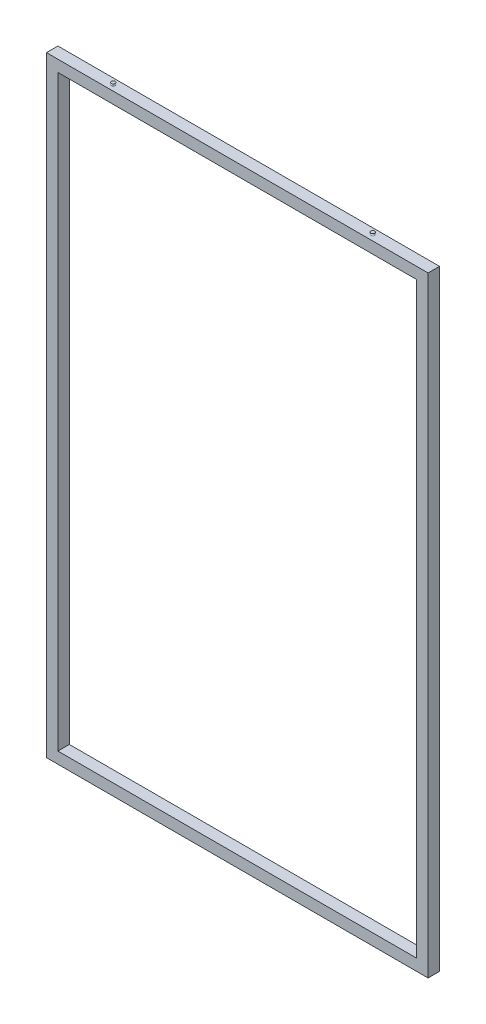
ISO-10303-21;
HEADER;
FILE_DESCRIPTION(('STEP AP214'),'2;1');
FILE_NAME('part.step','',(''),(''),'','','');
FILE_SCHEMA(('AUTOMOTIVE_DESIGN { 1 0 10303 214 1 1 1 1 }'));
ENDSEC;
DATA;
#1=APPLICATION_CONTEXT('core data for automotive mechanical design processes');
#2=APPLICATION_PROTOCOL_DEFINITION('international standard','automotive_design',2000,#1);
#3=PRODUCT_CONTEXT('',#1,'mechanical');
#4=PRODUCT('Part','Part','',(#3));
#5=PRODUCT_RELATED_PRODUCT_CATEGORY('part','',(#4));
#6=PRODUCT_DEFINITION_FORMATION('','',#4);
#7=PRODUCT_DEFINITION_CONTEXT('part definition',#1,'design');
#8=PRODUCT_DEFINITION('design','',#6,#7);
#9=PRODUCT_DEFINITION_SHAPE('','',#8);
#10=(LENGTH_UNIT() NAMED_UNIT(*) SI_UNIT(.MILLI.,.METRE.));
#11=(NAMED_UNIT(*) PLANE_ANGLE_UNIT() SI_UNIT($,.RADIAN.));
#12=(NAMED_UNIT(*) SI_UNIT($,.STERADIAN.) SOLID_ANGLE_UNIT());
#13=UNCERTAINTY_MEASURE_WITH_UNIT(LENGTH_MEASURE(1.E-05),#10,'distance_accuracy_value','');
#14=(GEOMETRIC_REPRESENTATION_CONTEXT(3) GLOBAL_UNCERTAINTY_ASSIGNED_CONTEXT((#13)) GLOBAL_UNIT_ASSIGNED_CONTEXT((#10,
#11,#12)) REPRESENTATION_CONTEXT('',''));
#15=CARTESIAN_POINT('',(0.,0.,0.));
#16=DIRECTION('',(0.,0.,1.));
#17=DIRECTION('',(1.,0.,0.));
#18=AXIS2_PLACEMENT_3D('',#15,#16,#17);
#19=CARTESIAN_POINT('',(0.,0.,15.));
#20=DIRECTION('',(0.,0.,1.));
#21=DIRECTION('',(1.,0.,0.));
#22=AXIS2_PLACEMENT_3D('',#19,#20,#21);
#23=PLANE('',#22);
#24=DIRECTION('',(0.,1.,0.));
#25=VECTOR('',#24,1.);
#26=CARTESIAN_POINT('',(500.,800.,15.));
#27=LINE('',#26,#25);
#28=CARTESIAN_POINT('',(500.,-800.,15.));
#29=VERTEX_POINT('',#28);
#30=CARTESIAN_POINT('',(500.,800.,15.));
#31=VERTEX_POINT('',#30);
#32=EDGE_CURVE('E315',#29,#31,#27,.T.);
#33=ORIENTED_EDGE('',*,*,#32,.T.);
#34=DIRECTION('',(-1.,0.,0.));
#35=VECTOR('',#34,1.);
#36=CARTESIAN_POINT('',(-500.,800.,15.));
#37=LINE('',#36,#35);
#38=CARTESIAN_POINT('',(-500.,800.,15.));
#39=VERTEX_POINT('',#38);
#40=EDGE_CURVE('E318',#31,#39,#37,.T.);
#41=ORIENTED_EDGE('',*,*,#40,.T.);
#42=DIRECTION('',(0.,-1.,0.));
#43=VECTOR('',#42,1.);
#44=CARTESIAN_POINT('',(-500.,800.,15.));
#45=LINE('',#44,#43);
#46=CARTESIAN_POINT('',(-500.,-800.,15.));
#47=VERTEX_POINT('',#46);
#48=EDGE_CURVE('E321',#39,#47,#45,.T.);
#49=ORIENTED_EDGE('',*,*,#48,.T.);
#50=DIRECTION('',(1.,0.,0.));
#51=VECTOR('',#50,1.);
#52=CARTESIAN_POINT('',(-500.,-800.,15.));
#53=LINE('',#52,#51);
#54=EDGE_CURVE('E323',#47,#29,#53,.T.);
#55=ORIENTED_EDGE('',*,*,#54,.T.);
#56=EDGE_LOOP('',(#33,#41,#49,#55));
#57=FACE_BOUND('',#56,.T.);
#58=DIRECTION('',(1.,0.,0.));
#59=VECTOR('',#58,1.);
#60=CARTESIAN_POINT('',(-470.,-770.,15.));
#61=LINE('',#60,#59);
#62=CARTESIAN_POINT('',(-470.,-770.,15.));
#63=VERTEX_POINT('',#62);
#64=CARTESIAN_POINT('',(470.,-770.,15.));
#65=VERTEX_POINT('',#64);
#66=EDGE_CURVE('E293',#63,#65,#61,.T.);
#67=ORIENTED_EDGE('',*,*,#66,.F.);
#68=DIRECTION('',(0.,-1.,0.));
#69=VECTOR('',#68,1.);
#70=CARTESIAN_POINT('',(-470.,770.,15.));
#71=LINE('',#70,#69);
#72=CARTESIAN_POINT('',(-470.,770.,15.));
#73=VERTEX_POINT('',#72);
#74=EDGE_CURVE('E291',#73,#63,#71,.T.);
#75=ORIENTED_EDGE('',*,*,#74,.F.);
#76=DIRECTION('',(-1.,0.,0.));
#77=VECTOR('',#76,1.);
#78=CARTESIAN_POINT('',(-470.,770.,15.));
#79=LINE('',#78,#77);
#80=CARTESIAN_POINT('',(470.,770.,15.));
#81=VERTEX_POINT('',#80);
#82=EDGE_CURVE('E298',#81,#73,#79,.T.);
#83=ORIENTED_EDGE('',*,*,#82,.F.);
#84=DIRECTION('',(0.,1.,0.));
#85=VECTOR('',#84,1.);
#86=CARTESIAN_POINT('',(470.,770.,15.));
#87=LINE('',#86,#85);
#88=EDGE_CURVE('E296',#65,#81,#87,.T.);
#89=ORIENTED_EDGE('',*,*,#88,.F.);
#90=EDGE_LOOP('',(#67,#75,#83,#89));
#91=FACE_BOUND('',#90,.T.);
#92=ADVANCED_FACE('F52',(#57,#91),#23,.T.);
#93=CARTESIAN_POINT('',(0.,0.,-15.));
#94=DIRECTION('',(0.,0.,1.));
#95=DIRECTION('',(1.,0.,0.));
#96=AXIS2_PLACEMENT_3D('',#93,#94,#95);
#97=PLANE('',#96);
#98=DIRECTION('',(0.,1.,0.));
#99=VECTOR('',#98,1.);
#100=CARTESIAN_POINT('',(500.,800.,-15.));
#101=LINE('',#100,#99);
#102=CARTESIAN_POINT('',(500.,-800.,-15.));
#103=VERTEX_POINT('',#102);
#104=CARTESIAN_POINT('',(500.,800.,-15.));
#105=VERTEX_POINT('',#104);
#106=EDGE_CURVE('E314',#103,#105,#101,.T.);
#107=ORIENTED_EDGE('',*,*,#106,.F.);
#108=DIRECTION('',(1.,0.,0.));
#109=VECTOR('',#108,1.);
#110=CARTESIAN_POINT('',(-500.,-800.,-15.));
#111=LINE('',#110,#109);
#112=CARTESIAN_POINT('',(-500.,-800.,-15.));
#113=VERTEX_POINT('',#112);
#114=EDGE_CURVE('E319',#113,#103,#111,.T.);
#115=ORIENTED_EDGE('',*,*,#114,.F.);
#116=DIRECTION('',(0.,-1.,0.));
#117=VECTOR('',#116,1.);
#118=CARTESIAN_POINT('',(-500.,800.,-15.));
#119=LINE('',#118,#117);
#120=CARTESIAN_POINT('',(-500.,800.,-15.));
#121=VERTEX_POINT('',#120);
#122=EDGE_CURVE('E330',#121,#113,#119,.T.);
#123=ORIENTED_EDGE('',*,*,#122,.F.);
#124=DIRECTION('',(-1.,0.,0.));
#125=VECTOR('',#124,1.);
#126=CARTESIAN_POINT('',(-500.,800.,-15.));
#127=LINE('',#126,#125);
#128=EDGE_CURVE('E328',#105,#121,#127,.T.);
#129=ORIENTED_EDGE('',*,*,#128,.F.);
#130=EDGE_LOOP('',(#107,#115,#123,#129));
#131=FACE_BOUND('',#130,.T.);
#132=DIRECTION('',(0.,-1.,0.));
#133=VECTOR('',#132,1.);
#134=CARTESIAN_POINT('',(-470.,770.,-15.));
#135=LINE('',#134,#133);
#136=CARTESIAN_POINT('',(-470.,770.,-15.));
#137=VERTEX_POINT('',#136);
#138=CARTESIAN_POINT('',(-470.,-770.,-15.));
#139=VERTEX_POINT('',#138);
#140=EDGE_CURVE('E75',#137,#139,#135,.T.);
#141=ORIENTED_EDGE('',*,*,#140,.T.);
#142=DIRECTION('',(1.,0.,0.));
#143=VECTOR('',#142,1.);
#144=CARTESIAN_POINT('',(-470.,-770.,-15.));
#145=LINE('',#144,#143);
#146=CARTESIAN_POINT('',(470.,-770.,-15.));
#147=VERTEX_POINT('',#146);
#148=EDGE_CURVE('E219',#139,#147,#145,.T.);
#149=ORIENTED_EDGE('',*,*,#148,.T.);
#150=DIRECTION('',(0.,1.,0.));
#151=VECTOR('',#150,1.);
#152=CARTESIAN_POINT('',(470.,770.,-15.));
#153=LINE('',#152,#151);
#154=CARTESIAN_POINT('',(470.,770.,-15.));
#155=VERTEX_POINT('',#154);
#156=EDGE_CURVE('E303',#147,#155,#153,.T.);
#157=ORIENTED_EDGE('',*,*,#156,.T.);
#158=DIRECTION('',(-1.,0.,0.));
#159=VECTOR('',#158,1.);
#160=CARTESIAN_POINT('',(-470.,770.,-15.));
#161=LINE('',#160,#159);
#162=EDGE_CURVE('E294',#155,#137,#161,.T.);
#163=ORIENTED_EDGE('',*,*,#162,.T.);
#164=EDGE_LOOP('',(#141,#149,#157,#163));
#165=FACE_BOUND('',#164,.T.);
#166=ADVANCED_FACE('F348',(#131,#165),#97,.F.);
#167=CARTESIAN_POINT('',(500.,800.,15.));
#168=DIRECTION('',(-1.,0.,0.));
#169=DIRECTION('',(0.,-1.,0.));
#170=AXIS2_PLACEMENT_3D('',#167,#168,#169);
#171=PLANE('',#170);
#172=ORIENTED_EDGE('',*,*,#106,.T.);
#173=DIRECTION('',(0.,0.,-1.));
#174=VECTOR('',#173,1.);
#175=CARTESIAN_POINT('',(500.,800.,15.));
#176=LINE('',#175,#174);
#177=EDGE_CURVE('E13',#31,#105,#176,.T.);
#178=ORIENTED_EDGE('',*,*,#177,.F.);
#179=ORIENTED_EDGE('',*,*,#32,.F.);
#180=DIRECTION('',(0.,0.,-1.));
#181=VECTOR('',#180,1.);
#182=CARTESIAN_POINT('',(500.,-800.,15.));
#183=LINE('',#182,#181);
#184=EDGE_CURVE('E325',#29,#103,#183,.T.);
#185=ORIENTED_EDGE('',*,*,#184,.T.);
#186=EDGE_LOOP('',(#172,#178,#179,#185));
#187=FACE_BOUND('',#186,.T.);
#188=ADVANCED_FACE('F54',(#187),#171,.F.);
#189=CARTESIAN_POINT('',(-500.,800.,15.));
#190=DIRECTION('',(0.,-1.,0.));
#191=DIRECTION('',(0.,0.,-1.));
#192=AXIS2_PLACEMENT_3D('',#189,#190,#191);
#193=PLANE('',#192);
#194=CARTESIAN_POINT('',(340.,800.,0.));
#195=DIRECTION('',(0.,1.,0.));
#196=DIRECTION('',(0.,0.,-1.));
#197=AXIS2_PLACEMENT_3D('',#194,#195,#196);
#198=CIRCLE('',#197,5.);
#199=CARTESIAN_POINT('',(340.,800.,-5.));
#200=VERTEX_POINT('',#199);
#201=EDGE_CURVE('E490',#200,#200,#198,.T.);
#202=ORIENTED_EDGE('',*,*,#201,.F.);
#203=EDGE_LOOP('',(#202));
#204=FACE_BOUND('',#203,.T.);
#205=CARTESIAN_POINT('',(-340.,800.,0.));
#206=DIRECTION('',(0.,-1.,0.));
#207=DIRECTION('',(0.,0.,-1.));
#208=AXIS2_PLACEMENT_3D('',#205,#206,#207);
#209=CIRCLE('',#208,5.);
#210=CARTESIAN_POINT('',(-340.,800.,-5.));
#211=VERTEX_POINT('',#210);
#212=EDGE_CURVE('E494',#211,#211,#209,.T.);
#213=ORIENTED_EDGE('',*,*,#212,.T.);
#214=EDGE_LOOP('',(#213));
#215=FACE_BOUND('',#214,.T.);
#216=ORIENTED_EDGE('',*,*,#128,.T.);
#217=DIRECTION('',(0.,0.,-1.));
#218=VECTOR('',#217,1.);
#219=CARTESIAN_POINT('',(-500.,800.,15.));
#220=LINE('',#219,#218);
#221=EDGE_CURVE('E60',#39,#121,#220,.T.);
#222=ORIENTED_EDGE('',*,*,#221,.F.);
#223=ORIENTED_EDGE('',*,*,#40,.F.);
#224=ORIENTED_EDGE('',*,*,#177,.T.);
#225=EDGE_LOOP('',(#216,#222,#223,#224));
#226=FACE_BOUND('',#225,.T.);
#227=ADVANCED_FACE('F359',(#204,#215,#226),#193,.F.);
#228=CARTESIAN_POINT('',(-500.,800.,15.));
#229=DIRECTION('',(1.,0.,0.));
#230=DIRECTION('',(0.,1.,0.));
#231=AXIS2_PLACEMENT_3D('',#228,#229,#230);
#232=PLANE('',#231);
#233=ORIENTED_EDGE('',*,*,#122,.T.);
#234=DIRECTION('',(0.,0.,-1.));
#235=VECTOR('',#234,1.);
#236=CARTESIAN_POINT('',(-500.,-800.,15.));
#237=LINE('',#236,#235);
#238=EDGE_CURVE('E335',#47,#113,#237,.T.);
#239=ORIENTED_EDGE('',*,*,#238,.F.);
#240=ORIENTED_EDGE('',*,*,#48,.F.);
#241=ORIENTED_EDGE('',*,*,#221,.T.);
#242=EDGE_LOOP('',(#233,#239,#240,#241));
#243=FACE_BOUND('',#242,.T.);
#244=ADVANCED_FACE('F342',(#243),#232,.F.);
#245=CARTESIAN_POINT('',(-500.,-800.,15.));
#246=DIRECTION('',(0.,1.,0.));
#247=DIRECTION('',(0.,0.,1.));
#248=AXIS2_PLACEMENT_3D('',#245,#246,#247);
#249=PLANE('',#248);
#250=ORIENTED_EDGE('',*,*,#114,.T.);
#251=ORIENTED_EDGE('',*,*,#184,.F.);
#252=ORIENTED_EDGE('',*,*,#54,.F.);
#253=ORIENTED_EDGE('',*,*,#238,.T.);
#254=EDGE_LOOP('',(#250,#251,#252,#253));
#255=FACE_BOUND('',#254,.T.);
#256=ADVANCED_FACE('F352',(#255),#249,.F.);
#257=CARTESIAN_POINT('',(-470.,770.,15.));
#258=DIRECTION('',(1.,0.,0.));
#259=DIRECTION('',(0.,1.,0.));
#260=AXIS2_PLACEMENT_3D('',#257,#258,#259);
#261=PLANE('',#260);
#262=ORIENTED_EDGE('',*,*,#140,.F.);
#263=DIRECTION('',(0.,0.,-1.));
#264=VECTOR('',#263,1.);
#265=CARTESIAN_POINT('',(-470.,770.,15.));
#266=LINE('',#265,#264);
#267=EDGE_CURVE('E299',#73,#137,#266,.T.);
#268=ORIENTED_EDGE('',*,*,#267,.F.);
#269=ORIENTED_EDGE('',*,*,#74,.T.);
#270=DIRECTION('',(0.,0.,-1.));
#271=VECTOR('',#270,1.);
#272=CARTESIAN_POINT('',(-470.,-770.,15.));
#273=LINE('',#272,#271);
#274=EDGE_CURVE('E312',#63,#139,#273,.T.);
#275=ORIENTED_EDGE('',*,*,#274,.T.);
#276=EDGE_LOOP('',(#262,#268,#269,#275));
#277=FACE_BOUND('',#276,.T.);
#278=ADVANCED_FACE('F376',(#277),#261,.T.);
#279=CARTESIAN_POINT('',(-470.,-770.,15.));
#280=DIRECTION('',(0.,1.,0.));
#281=DIRECTION('',(0.,0.,1.));
#282=AXIS2_PLACEMENT_3D('',#279,#280,#281);
#283=PLANE('',#282);
#284=ORIENTED_EDGE('',*,*,#148,.F.);
#285=ORIENTED_EDGE('',*,*,#274,.F.);
#286=ORIENTED_EDGE('',*,*,#66,.T.);
#287=DIRECTION('',(0.,0.,-1.));
#288=VECTOR('',#287,1.);
#289=CARTESIAN_POINT('',(470.,-770.,15.));
#290=LINE('',#289,#288);
#291=EDGE_CURVE('E310',#65,#147,#290,.T.);
#292=ORIENTED_EDGE('',*,*,#291,.T.);
#293=EDGE_LOOP('',(#284,#285,#286,#292));
#294=FACE_BOUND('',#293,.T.);
#295=ADVANCED_FACE('F383',(#294),#283,.T.);
#296=CARTESIAN_POINT('',(470.,770.,15.));
#297=DIRECTION('',(-1.,0.,0.));
#298=DIRECTION('',(0.,-1.,0.));
#299=AXIS2_PLACEMENT_3D('',#296,#297,#298);
#300=PLANE('',#299);
#301=ORIENTED_EDGE('',*,*,#156,.F.);
#302=ORIENTED_EDGE('',*,*,#291,.F.);
#303=ORIENTED_EDGE('',*,*,#88,.T.);
#304=DIRECTION('',(0.,0.,-1.));
#305=VECTOR('',#304,1.);
#306=CARTESIAN_POINT('',(470.,770.,15.));
#307=LINE('',#306,#305);
#308=EDGE_CURVE('E67',#81,#155,#307,.T.);
#309=ORIENTED_EDGE('',*,*,#308,.T.);
#310=EDGE_LOOP('',(#301,#302,#303,#309));
#311=FACE_BOUND('',#310,.T.);
#312=ADVANCED_FACE('F387',(#311),#300,.T.);
#313=CARTESIAN_POINT('',(-470.,770.,15.));
#314=DIRECTION('',(0.,-1.,0.));
#315=DIRECTION('',(0.,0.,-1.));
#316=AXIS2_PLACEMENT_3D('',#313,#314,#315);
#317=PLANE('',#316);
#318=ORIENTED_EDGE('',*,*,#162,.F.);
#319=ORIENTED_EDGE('',*,*,#308,.F.);
#320=ORIENTED_EDGE('',*,*,#82,.T.);
#321=ORIENTED_EDGE('',*,*,#267,.T.);
#322=EDGE_LOOP('',(#318,#319,#320,#321));
#323=FACE_BOUND('',#322,.T.);
#324=ADVANCED_FACE('F392',(#323),#317,.T.);
#325=CARTESIAN_POINT('',(-345.,805.,0.));
#326=DIRECTION('',(0.,-1.,0.));
#327=DIRECTION('',(0.,0.,-1.));
#328=AXIS2_PLACEMENT_3D('',#325,#326,#327);
#329=PLANE('',#328);
#330=CARTESIAN_POINT('',(-340.,805.,0.));
#331=DIRECTION('',(0.,-1.,0.));
#332=DIRECTION('',(0.,0.,-1.));
#333=AXIS2_PLACEMENT_3D('',#330,#331,#332);
#334=CIRCLE('',#333,5.);
#335=CARTESIAN_POINT('',(-340.,805.,-5.));
#336=VERTEX_POINT('',#335);
#337=EDGE_CURVE('E283',#336,#336,#334,.T.);
#338=ORIENTED_EDGE('',*,*,#337,.F.);
#339=EDGE_LOOP('',(#338));
#340=FACE_BOUND('',#339,.T.);
#341=ADVANCED_FACE('F398',(#340),#329,.F.);
#342=CARTESIAN_POINT('',(-340.,802.5,0.));
#343=DIRECTION('',(0.,-1.,0.));
#344=DIRECTION('',(0.,0.,-1.));
#345=AXIS2_PLACEMENT_3D('',#342,#343,#344);
#346=TOROIDAL_SURFACE('',#345,5.,2.49999999999995);
#347=ORIENTED_EDGE('',*,*,#212,.F.);
#348=EDGE_LOOP('',(#347));
#349=FACE_BOUND('',#348,.T.);
#350=ORIENTED_EDGE('',*,*,#337,.T.);
#351=EDGE_LOOP('',(#350));
#352=FACE_BOUND('',#351,.T.);
#353=ADVANCED_FACE('F474',(#349,#352),#346,.F.);
#354=CARTESIAN_POINT('',(345.,805.,0.));
#355=DIRECTION('',(0.,-1.,0.));
#356=DIRECTION('',(0.,0.,-1.));
#357=AXIS2_PLACEMENT_3D('',#354,#355,#356);
#358=PLANE('',#357);
#359=CARTESIAN_POINT('',(340.,805.,0.));
#360=DIRECTION('',(0.,1.,0.));
#361=DIRECTION('',(0.,0.,-1.));
#362=AXIS2_PLACEMENT_3D('',#359,#360,#361);
#363=CIRCLE('',#362,5.);
#364=CARTESIAN_POINT('',(340.,805.,-5.));
#365=VERTEX_POINT('',#364);
#366=EDGE_CURVE('E493',#365,#365,#363,.T.);
#367=ORIENTED_EDGE('',*,*,#366,.T.);
#368=EDGE_LOOP('',(#367));
#369=FACE_BOUND('',#368,.T.);
#370=ADVANCED_FACE('F478',(#369),#358,.F.);
#371=CARTESIAN_POINT('',(340.,802.5,0.));
#372=DIRECTION('',(0.,-1.,0.));
#373=DIRECTION('',(0.,0.,-1.));
#374=AXIS2_PLACEMENT_3D('',#371,#372,#373);
#375=TOROIDAL_SURFACE('',#374,5.,2.49999999999995);
#376=ORIENTED_EDGE('',*,*,#201,.T.);
#377=EDGE_LOOP('',(#376));
#378=FACE_BOUND('',#377,.T.);
#379=ORIENTED_EDGE('',*,*,#366,.F.);
#380=EDGE_LOOP('',(#379));
#381=FACE_BOUND('',#380,.T.);
#382=ADVANCED_FACE('F482',(#378,#381),#375,.F.);
#383=CLOSED_SHELL('',(#92,#166,#188,#227,#244,#256,#278,#295,#312,#324,#341,#353,#370,#382));
#384=CARTESIAN_POINT('',(-498.,-799.4,13.));
#385=DIRECTION('',(0.,0.,1.));
#386=DIRECTION('',(1.,0.,0.));
#387=AXIS2_PLACEMENT_3D('',#384,#385,#386);
#388=PLANE('',#387);
#389=DIRECTION('',(0.,1.,0.));
#390=VECTOR('',#389,1.);
#391=CARTESIAN_POINT('',(-472.,-799.4,13.));
#392=LINE('',#391,#390);
#393=CARTESIAN_POINT('',(-472.,-772.,13.));
#394=VERTEX_POINT('',#393);
#395=CARTESIAN_POINT('',(-472.,772.,13.));
#396=VERTEX_POINT('',#395);
#397=EDGE_CURVE('E252',#394,#396,#392,.T.);
#398=ORIENTED_EDGE('',*,*,#397,.F.);
#399=DIRECTION('',(-0.707106781186548,-0.707106781186548,0.));
#400=VECTOR('',#399,1.);
#401=CARTESIAN_POINT('',(0.700000000000089,-299.3,13.));
#402=LINE('',#401,#400);
#403=CARTESIAN_POINT('',(-498.,-798.,13.));
#404=VERTEX_POINT('',#403);
#405=EDGE_CURVE('E230',#394,#404,#402,.T.);
#406=ORIENTED_EDGE('',*,*,#405,.T.);
#407=DIRECTION('',(0.,1.,0.));
#408=VECTOR('',#407,1.);
#409=CARTESIAN_POINT('',(-498.,-799.4,13.));
#410=LINE('',#409,#408);
#411=CARTESIAN_POINT('',(-498.,798.,13.));
#412=VERTEX_POINT('',#411);
#413=EDGE_CURVE('E279',#404,#412,#410,.T.);
#414=ORIENTED_EDGE('',*,*,#413,.T.);
#415=DIRECTION('',(-0.707106781186548,0.707106781186548,0.));
#416=VECTOR('',#415,1.);
#417=CARTESIAN_POINT('',(-498.7,798.7,13.));
#418=LINE('',#417,#416);
#419=EDGE_CURVE('E259',#396,#412,#418,.T.);
#420=ORIENTED_EDGE('',*,*,#419,.F.);
#421=EDGE_LOOP('',(#398,#406,#414,#420));
#422=FACE_BOUND('',#421,.T.);
#423=ADVANCED_FACE('F399',(#422),#388,.F.);
#424=CARTESIAN_POINT('',(-498.,-799.4,13.));
#425=DIRECTION('',(-1.,0.,0.));
#426=DIRECTION('',(0.,0.,1.));
#427=AXIS2_PLACEMENT_3D('',#424,#425,#426);
#428=PLANE('',#427);
#429=ORIENTED_EDGE('',*,*,#413,.F.);
#430=DIRECTION('',(0.,0.,-1.));
#431=VECTOR('',#430,1.);
#432=CARTESIAN_POINT('',(-498.,-798.,13.));
#433=LINE('',#432,#431);
#434=CARTESIAN_POINT('',(-498.,-798.,-13.));
#435=VERTEX_POINT('',#434);
#436=EDGE_CURVE('E227',#404,#435,#433,.T.);
#437=ORIENTED_EDGE('',*,*,#436,.T.);
#438=DIRECTION('',(0.,1.,0.));
#439=VECTOR('',#438,1.);
#440=CARTESIAN_POINT('',(-498.,-799.4,-13.));
#441=LINE('',#440,#439);
#442=CARTESIAN_POINT('',(-498.,798.,-13.));
#443=VERTEX_POINT('',#442);
#444=EDGE_CURVE('E282',#435,#443,#441,.T.);
#445=ORIENTED_EDGE('',*,*,#444,.T.);
#446=DIRECTION('',(0.,0.,-1.));
#447=VECTOR('',#446,1.);
#448=CARTESIAN_POINT('',(-498.,798.,13.));
#449=LINE('',#448,#447);
#450=EDGE_CURVE('E261',#412,#443,#449,.T.);
#451=ORIENTED_EDGE('',*,*,#450,.F.);
#452=EDGE_LOOP('',(#429,#437,#445,#451));
#453=FACE_BOUND('',#452,.T.);
#454=ADVANCED_FACE('F402',(#453),#428,.F.);
#455=CARTESIAN_POINT('',(-498.,-799.4,-13.));
#456=DIRECTION('',(0.,0.,-1.));
#457=DIRECTION('',(-1.,0.,0.));
#458=AXIS2_PLACEMENT_3D('',#455,#456,#457);
#459=PLANE('',#458);
#460=ORIENTED_EDGE('',*,*,#444,.F.);
#461=DIRECTION('',(0.707106781186548,0.707106781186548,0.));
#462=VECTOR('',#461,1.);
#463=CARTESIAN_POINT('',(0.700000000000089,-299.3,-13.));
#464=LINE('',#463,#462);
#465=CARTESIAN_POINT('',(-472.,-772.,-13.));
#466=VERTEX_POINT('',#465);
#467=EDGE_CURVE('E212',#435,#466,#464,.T.);
#468=ORIENTED_EDGE('',*,*,#467,.T.);
#469=DIRECTION('',(0.,1.,0.));
#470=VECTOR('',#469,1.);
#471=CARTESIAN_POINT('',(-472.,-799.4,-13.));
#472=LINE('',#471,#470);
#473=CARTESIAN_POINT('',(-472.,772.,-13.));
#474=VERTEX_POINT('',#473);
#475=EDGE_CURVE('E286',#466,#474,#472,.T.);
#476=ORIENTED_EDGE('',*,*,#475,.T.);
#477=DIRECTION('',(0.707106781186548,-0.707106781186548,0.));
#478=VECTOR('',#477,1.);
#479=CARTESIAN_POINT('',(-498.7,798.7,-13.));
#480=LINE('',#479,#478);
#481=EDGE_CURVE('E263',#443,#474,#480,.T.);
#482=ORIENTED_EDGE('',*,*,#481,.F.);
#483=EDGE_LOOP('',(#460,#468,#476,#482));
#484=FACE_BOUND('',#483,.T.);
#485=ADVANCED_FACE('F407',(#484),#459,.F.);
#486=CARTESIAN_POINT('',(-472.,-799.4,13.));
#487=DIRECTION('',(1.,0.,0.));
#488=DIRECTION('',(0.,0.,-1.));
#489=AXIS2_PLACEMENT_3D('',#486,#487,#488);
#490=PLANE('',#489);
#491=ORIENTED_EDGE('',*,*,#475,.F.);
#492=DIRECTION('',(0.,0.,1.));
#493=VECTOR('',#492,1.);
#494=CARTESIAN_POINT('',(-472.,-772.,13.));
#495=LINE('',#494,#493);
#496=EDGE_CURVE('E233',#466,#394,#495,.T.);
#497=ORIENTED_EDGE('',*,*,#496,.T.);
#498=ORIENTED_EDGE('',*,*,#397,.T.);
#499=DIRECTION('',(0.,0.,1.));
#500=VECTOR('',#499,1.);
#501=CARTESIAN_POINT('',(-472.,772.,13.));
#502=LINE('',#501,#500);
#503=EDGE_CURVE('E238',#474,#396,#502,.T.);
#504=ORIENTED_EDGE('',*,*,#503,.F.);
#505=EDGE_LOOP('',(#491,#497,#498,#504));
#506=FACE_BOUND('',#505,.T.);
#507=ADVANCED_FACE('F411',(#506),#490,.F.);
#508=CARTESIAN_POINT('',(-499.4,772.,13.));
#509=DIRECTION('',(0.,-1.,0.));
#510=DIRECTION('',(0.,0.,-1.));
#511=AXIS2_PLACEMENT_3D('',#508,#509,#510);
#512=PLANE('',#511);
#513=ORIENTED_EDGE('',*,*,#503,.T.);
#514=DIRECTION('',(1.,0.,0.));
#515=VECTOR('',#514,1.);
#516=CARTESIAN_POINT('',(-499.4,772.,13.));
#517=LINE('',#516,#515);
#518=CARTESIAN_POINT('',(0.,772.,13.));
#519=VERTEX_POINT('',#518);
#520=EDGE_CURVE('E249',#396,#519,#517,.T.);
#521=ORIENTED_EDGE('',*,*,#520,.T.);
#522=DIRECTION('',(0.,0.,-1.));
#523=VECTOR('',#522,1.);
#524=CARTESIAN_POINT('',(0.,772.,13.));
#525=LINE('',#524,#523);
#526=CARTESIAN_POINT('',(0.,772.,-13.));
#527=VERTEX_POINT('',#526);
#528=EDGE_CURVE('E198',#519,#527,#525,.T.);
#529=ORIENTED_EDGE('',*,*,#528,.T.);
#530=DIRECTION('',(1.,0.,0.));
#531=VECTOR('',#530,1.);
#532=CARTESIAN_POINT('',(-499.4,772.,-13.));
#533=LINE('',#532,#531);
#534=EDGE_CURVE('E251',#474,#527,#533,.T.);
#535=ORIENTED_EDGE('',*,*,#534,.F.);
#536=EDGE_LOOP('',(#513,#521,#529,#535));
#537=FACE_BOUND('',#536,.T.);
#538=ADVANCED_FACE('F415',(#537),#512,.F.);
#539=CARTESIAN_POINT('',(-499.4,798.,-13.));
#540=DIRECTION('',(0.,0.,-1.));
#541=DIRECTION('',(0.,1.,0.));
#542=AXIS2_PLACEMENT_3D('',#539,#540,#541);
#543=PLANE('',#542);
#544=ORIENTED_EDGE('',*,*,#481,.T.);
#545=ORIENTED_EDGE('',*,*,#534,.T.);
#546=DIRECTION('',(0.,1.,0.));
#547=VECTOR('',#546,1.);
#548=CARTESIAN_POINT('',(0.,798.,-13.));
#549=LINE('',#548,#547);
#550=CARTESIAN_POINT('',(0.,798.,-13.));
#551=VERTEX_POINT('',#550);
#552=EDGE_CURVE('E266',#527,#551,#549,.T.);
#553=ORIENTED_EDGE('',*,*,#552,.T.);
#554=DIRECTION('',(1.,0.,0.));
#555=VECTOR('',#554,1.);
#556=CARTESIAN_POINT('',(-499.4,798.,-13.));
#557=LINE('',#556,#555);
#558=EDGE_CURVE('E254',#443,#551,#557,.T.);
#559=ORIENTED_EDGE('',*,*,#558,.F.);
#560=EDGE_LOOP('',(#544,#545,#553,#559));
#561=FACE_BOUND('',#560,.T.);
#562=ADVANCED_FACE('F433',(#561),#543,.F.);
#563=CARTESIAN_POINT('',(-499.4,798.,13.));
#564=DIRECTION('',(0.,1.,0.));
#565=DIRECTION('',(0.,0.,1.));
#566=AXIS2_PLACEMENT_3D('',#563,#564,#565);
#567=PLANE('',#566);
#568=ORIENTED_EDGE('',*,*,#450,.T.);
#569=ORIENTED_EDGE('',*,*,#558,.T.);
#570=DIRECTION('',(0.,0.,1.));
#571=VECTOR('',#570,1.);
#572=CARTESIAN_POINT('',(0.,798.,13.));
#573=LINE('',#572,#571);
#574=CARTESIAN_POINT('',(0.,798.,13.));
#575=VERTEX_POINT('',#574);
#576=EDGE_CURVE('E269',#551,#575,#573,.T.);
#577=ORIENTED_EDGE('',*,*,#576,.T.);
#578=DIRECTION('',(1.,0.,0.));
#579=VECTOR('',#578,1.);
#580=CARTESIAN_POINT('',(-499.4,798.,13.));
#581=LINE('',#580,#579);
#582=EDGE_CURVE('E256',#412,#575,#581,.T.);
#583=ORIENTED_EDGE('',*,*,#582,.F.);
#584=EDGE_LOOP('',(#568,#569,#577,#583));
#585=FACE_BOUND('',#584,.T.);
#586=ADVANCED_FACE('F437',(#585),#567,.F.);
#587=CARTESIAN_POINT('',(-499.4,798.,13.));
#588=DIRECTION('',(0.,0.,1.));
#589=DIRECTION('',(1.,0.,0.));
#590=AXIS2_PLACEMENT_3D('',#587,#588,#589);
#591=PLANE('',#590);
#592=ORIENTED_EDGE('',*,*,#419,.T.);
#593=ORIENTED_EDGE('',*,*,#582,.T.);
#594=DIRECTION('',(0.,-1.,0.));
#595=VECTOR('',#594,1.);
#596=CARTESIAN_POINT('',(0.,798.,13.));
#597=LINE('',#596,#595);
#598=EDGE_CURVE('E203',#575,#519,#597,.T.);
#599=ORIENTED_EDGE('',*,*,#598,.T.);
#600=ORIENTED_EDGE('',*,*,#520,.F.);
#601=EDGE_LOOP('',(#592,#593,#599,#600));
#602=FACE_BOUND('',#601,.T.);
#603=ADVANCED_FACE('F430',(#602),#591,.F.);
#604=CARTESIAN_POINT('',(0.,772.,13.));
#605=DIRECTION('',(0.,-1.,0.));
#606=DIRECTION('',(0.,0.,-1.));
#607=AXIS2_PLACEMENT_3D('',#604,#605,#606);
#608=PLANE('',#607);
#609=DIRECTION('',(1.,0.,0.));
#610=VECTOR('',#609,1.);
#611=CARTESIAN_POINT('',(0.,772.,-13.));
#612=LINE('',#611,#610);
#613=CARTESIAN_POINT('',(472.,772.,-13.));
#614=VERTEX_POINT('',#613);
#615=EDGE_CURVE('E202',#527,#614,#612,.T.);
#616=ORIENTED_EDGE('',*,*,#615,.F.);
#617=ORIENTED_EDGE('',*,*,#528,.F.);
#618=DIRECTION('',(1.,0.,0.));
#619=VECTOR('',#618,1.);
#620=CARTESIAN_POINT('',(0.,772.,13.));
#621=LINE('',#620,#619);
#622=CARTESIAN_POINT('',(472.,772.,13.));
#623=VERTEX_POINT('',#622);
#624=EDGE_CURVE('E194',#519,#623,#621,.T.);
#625=ORIENTED_EDGE('',*,*,#624,.T.);
#626=DIRECTION('',(0.,0.,1.));
#627=VECTOR('',#626,1.);
#628=CARTESIAN_POINT('',(472.,772.,13.));
#629=LINE('',#628,#627);
#630=EDGE_CURVE('E180',#614,#623,#629,.T.);
#631=ORIENTED_EDGE('',*,*,#630,.F.);
#632=EDGE_LOOP('',(#616,#617,#625,#631));
#633=FACE_BOUND('',#632,.T.);
#634=ADVANCED_FACE('F196',(#633),#608,.F.);
#635=CARTESIAN_POINT('',(0.,798.,-13.));
#636=DIRECTION('',(0.,0.,-1.));
#637=DIRECTION('',(0.,1.,0.));
#638=AXIS2_PLACEMENT_3D('',#635,#636,#637);
#639=PLANE('',#638);
#640=DIRECTION('',(1.,0.,0.));
#641=VECTOR('',#640,1.);
#642=CARTESIAN_POINT('',(0.,798.,-13.));
#643=LINE('',#642,#641);
#644=CARTESIAN_POINT('',(498.,798.,-13.));
#645=VERTEX_POINT('',#644);
#646=EDGE_CURVE('E275',#551,#645,#643,.T.);
#647=ORIENTED_EDGE('',*,*,#646,.F.);
#648=ORIENTED_EDGE('',*,*,#552,.F.);
#649=ORIENTED_EDGE('',*,*,#615,.T.);
#650=DIRECTION('',(-0.707106781186548,-0.707106781186548,0.));
#651=VECTOR('',#650,1.);
#652=CARTESIAN_POINT('',(498.7,798.7,-13.));
#653=LINE('',#652,#651);
#654=EDGE_CURVE('E189',#645,#614,#653,.T.);
#655=ORIENTED_EDGE('',*,*,#654,.F.);
#656=EDGE_LOOP('',(#647,#648,#649,#655));
#657=FACE_BOUND('',#656,.T.);
#658=ADVANCED_FACE('F423',(#657),#639,.F.);
#659=CARTESIAN_POINT('',(0.,798.,13.));
#660=DIRECTION('',(0.,1.,0.));
#661=DIRECTION('',(0.,0.,1.));
#662=AXIS2_PLACEMENT_3D('',#659,#660,#661);
#663=PLANE('',#662);
#664=DIRECTION('',(1.,0.,0.));
#665=VECTOR('',#664,1.);
#666=CARTESIAN_POINT('',(0.,798.,13.));
#667=LINE('',#666,#665);
#668=CARTESIAN_POINT('',(498.,798.,13.));
#669=VERTEX_POINT('',#668);
#670=EDGE_CURVE('E208',#575,#669,#667,.T.);
#671=ORIENTED_EDGE('',*,*,#670,.F.);
#672=ORIENTED_EDGE('',*,*,#576,.F.);
#673=ORIENTED_EDGE('',*,*,#646,.T.);
#674=DIRECTION('',(0.,0.,-1.));
#675=VECTOR('',#674,1.);
#676=CARTESIAN_POINT('',(498.,798.,13.));
#677=LINE('',#676,#675);
#678=EDGE_CURVE('E512',#669,#645,#677,.T.);
#679=ORIENTED_EDGE('',*,*,#678,.F.);
#680=EDGE_LOOP('',(#671,#672,#673,#679));
#681=FACE_BOUND('',#680,.T.);
#682=ADVANCED_FACE('F420',(#681),#663,.F.);
#683=CARTESIAN_POINT('',(0.,798.,13.));
#684=DIRECTION('',(0.,0.,1.));
#685=DIRECTION('',(1.,0.,0.));
#686=AXIS2_PLACEMENT_3D('',#683,#684,#685);
#687=PLANE('',#686);
#688=ORIENTED_EDGE('',*,*,#624,.F.);
#689=ORIENTED_EDGE('',*,*,#598,.F.);
#690=ORIENTED_EDGE('',*,*,#670,.T.);
#691=DIRECTION('',(0.707106781186548,0.707106781186548,0.));
#692=VECTOR('',#691,1.);
#693=CARTESIAN_POINT('',(498.7,798.7,13.));
#694=LINE('',#693,#692);
#695=EDGE_CURVE('E190',#623,#669,#694,.T.);
#696=ORIENTED_EDGE('',*,*,#695,.F.);
#697=EDGE_LOOP('',(#688,#689,#690,#696));
#698=FACE_BOUND('',#697,.T.);
#699=ADVANCED_FACE('F206',(#698),#687,.F.);
#700=CARTESIAN_POINT('',(499.4,-798.,13.));
#701=DIRECTION('',(0.,0.,1.));
#702=DIRECTION('',(1.,0.,0.));
#703=AXIS2_PLACEMENT_3D('',#700,#701,#702);
#704=PLANE('',#703);
#705=DIRECTION('',(-1.,0.,0.));
#706=VECTOR('',#705,1.);
#707=CARTESIAN_POINT('',(499.4,-772.,13.));
#708=LINE('',#707,#706);
#709=CARTESIAN_POINT('',(472.,-772.,13.));
#710=VERTEX_POINT('',#709);
#711=EDGE_CURVE('E244',#710,#394,#708,.T.);
#712=ORIENTED_EDGE('',*,*,#711,.F.);
#713=DIRECTION('',(0.707106781186548,-0.707106781186548,0.));
#714=VECTOR('',#713,1.);
#715=CARTESIAN_POINT('',(-300.7,0.699999999999923,13.));
#716=LINE('',#715,#714);
#717=CARTESIAN_POINT('',(498.,-798.,13.));
#718=VERTEX_POINT('',#717);
#719=EDGE_CURVE('E216',#710,#718,#716,.T.);
#720=ORIENTED_EDGE('',*,*,#719,.T.);
#721=DIRECTION('',(-1.,0.,0.));
#722=VECTOR('',#721,1.);
#723=CARTESIAN_POINT('',(499.4,-798.,13.));
#724=LINE('',#723,#722);
#725=EDGE_CURVE('E234',#718,#404,#724,.T.);
#726=ORIENTED_EDGE('',*,*,#725,.T.);
#727=ORIENTED_EDGE('',*,*,#405,.F.);
#728=EDGE_LOOP('',(#712,#720,#726,#727));
#729=FACE_BOUND('',#728,.T.);
#730=ADVANCED_FACE('F419',(#729),#704,.F.);
#731=CARTESIAN_POINT('',(499.4,-798.,13.));
#732=DIRECTION('',(0.,-1.,0.));
#733=DIRECTION('',(0.,0.,-1.));
#734=AXIS2_PLACEMENT_3D('',#731,#732,#733);
#735=PLANE('',#734);
#736=ORIENTED_EDGE('',*,*,#725,.F.);
#737=DIRECTION('',(0.,0.,-1.));
#738=VECTOR('',#737,1.);
#739=CARTESIAN_POINT('',(498.,-798.,13.));
#740=LINE('',#739,#738);
#741=CARTESIAN_POINT('',(498.,-798.,-13.));
#742=VERTEX_POINT('',#741);
#743=EDGE_CURVE('E507',#718,#742,#740,.T.);
#744=ORIENTED_EDGE('',*,*,#743,.T.);
#745=DIRECTION('',(-1.,0.,0.));
#746=VECTOR('',#745,1.);
#747=CARTESIAN_POINT('',(499.4,-798.,-13.));
#748=LINE('',#747,#746);
#749=EDGE_CURVE('E237',#742,#435,#748,.T.);
#750=ORIENTED_EDGE('',*,*,#749,.T.);
#751=ORIENTED_EDGE('',*,*,#436,.F.);
#752=EDGE_LOOP('',(#736,#744,#750,#751));
#753=FACE_BOUND('',#752,.T.);
#754=ADVANCED_FACE('F447',(#753),#735,.F.);
#755=CARTESIAN_POINT('',(499.4,-798.,-13.));
#756=DIRECTION('',(0.,0.,-1.));
#757=DIRECTION('',(0.,1.,0.));
#758=AXIS2_PLACEMENT_3D('',#755,#756,#757);
#759=PLANE('',#758);
#760=ORIENTED_EDGE('',*,*,#749,.F.);
#761=DIRECTION('',(-0.707106781186548,0.707106781186548,0.));
#762=VECTOR('',#761,1.);
#763=CARTESIAN_POINT('',(-300.7,0.699999999999923,-12.9999999999999));
#764=LINE('',#763,#762);
#765=CARTESIAN_POINT('',(472.,-772.,-13.));
#766=VERTEX_POINT('',#765);
#767=EDGE_CURVE('E510',#742,#766,#764,.T.);
#768=ORIENTED_EDGE('',*,*,#767,.T.);
#769=DIRECTION('',(-1.,0.,0.));
#770=VECTOR('',#769,1.);
#771=CARTESIAN_POINT('',(499.4,-772.,-13.));
#772=LINE('',#771,#770);
#773=EDGE_CURVE('E241',#766,#466,#772,.T.);
#774=ORIENTED_EDGE('',*,*,#773,.T.);
#775=ORIENTED_EDGE('',*,*,#467,.F.);
#776=EDGE_LOOP('',(#760,#768,#774,#775));
#777=FACE_BOUND('',#776,.T.);
#778=ADVANCED_FACE('F451',(#777),#759,.F.);
#779=CARTESIAN_POINT('',(499.4,-772.,13.));
#780=DIRECTION('',(0.,1.,0.));
#781=DIRECTION('',(0.,0.,1.));
#782=AXIS2_PLACEMENT_3D('',#779,#780,#781);
#783=PLANE('',#782);
#784=ORIENTED_EDGE('',*,*,#773,.F.);
#785=DIRECTION('',(0.,0.,1.));
#786=VECTOR('',#785,1.);
#787=CARTESIAN_POINT('',(472.,-772.,13.));
#788=LINE('',#787,#786);
#789=EDGE_CURVE('E502',#766,#710,#788,.T.);
#790=ORIENTED_EDGE('',*,*,#789,.T.);
#791=ORIENTED_EDGE('',*,*,#711,.T.);
#792=ORIENTED_EDGE('',*,*,#496,.F.);
#793=EDGE_LOOP('',(#784,#790,#791,#792));
#794=FACE_BOUND('',#793,.T.);
#795=ADVANCED_FACE('F455',(#794),#783,.F.);
#796=CARTESIAN_POINT('',(498.,799.4,13.));
#797=DIRECTION('',(0.,0.,1.));
#798=DIRECTION('',(1.,0.,0.));
#799=AXIS2_PLACEMENT_3D('',#796,#797,#798);
#800=PLANE('',#799);
#801=ORIENTED_EDGE('',*,*,#695,.T.);
#802=DIRECTION('',(0.,-1.,0.));
#803=VECTOR('',#802,1.);
#804=CARTESIAN_POINT('',(498.,799.4,13.));
#805=LINE('',#804,#803);
#806=EDGE_CURVE('E505',#669,#718,#805,.T.);
#807=ORIENTED_EDGE('',*,*,#806,.T.);
#808=ORIENTED_EDGE('',*,*,#719,.F.);
#809=DIRECTION('',(0.,-1.,0.));
#810=VECTOR('',#809,1.);
#811=CARTESIAN_POINT('',(472.,799.4,13.));
#812=LINE('',#811,#810);
#813=EDGE_CURVE('E184',#623,#710,#812,.T.);
#814=ORIENTED_EDGE('',*,*,#813,.F.);
#815=EDGE_LOOP('',(#801,#807,#808,#814));
#816=FACE_BOUND('',#815,.T.);
#817=ADVANCED_FACE('F214',(#816),#800,.F.);
#818=CARTESIAN_POINT('',(498.,799.4,13.));
#819=DIRECTION('',(1.,0.,0.));
#820=DIRECTION('',(0.,0.,-1.));
#821=AXIS2_PLACEMENT_3D('',#818,#819,#820);
#822=PLANE('',#821);
#823=ORIENTED_EDGE('',*,*,#678,.T.);
#824=DIRECTION('',(0.,-1.,0.));
#825=VECTOR('',#824,1.);
#826=CARTESIAN_POINT('',(498.,799.4,-13.));
#827=LINE('',#826,#825);
#828=EDGE_CURVE('E221',#645,#742,#827,.T.);
#829=ORIENTED_EDGE('',*,*,#828,.T.);
#830=ORIENTED_EDGE('',*,*,#743,.F.);
#831=ORIENTED_EDGE('',*,*,#806,.F.);
#832=EDGE_LOOP('',(#823,#829,#830,#831));
#833=FACE_BOUND('',#832,.T.);
#834=ADVANCED_FACE('F465',(#833),#822,.F.);
#835=CARTESIAN_POINT('',(498.,799.4,-13.));
#836=DIRECTION('',(0.,0.,-1.));
#837=DIRECTION('',(-1.,0.,0.));
#838=AXIS2_PLACEMENT_3D('',#835,#836,#837);
#839=PLANE('',#838);
#840=ORIENTED_EDGE('',*,*,#654,.T.);
#841=DIRECTION('',(0.,-1.,0.));
#842=VECTOR('',#841,1.);
#843=CARTESIAN_POINT('',(472.,799.4,-13.));
#844=LINE('',#843,#842);
#845=EDGE_CURVE('E186',#614,#766,#844,.T.);
#846=ORIENTED_EDGE('',*,*,#845,.T.);
#847=ORIENTED_EDGE('',*,*,#767,.F.);
#848=ORIENTED_EDGE('',*,*,#828,.F.);
#849=EDGE_LOOP('',(#840,#846,#847,#848));
#850=FACE_BOUND('',#849,.T.);
#851=ADVANCED_FACE('F462',(#850),#839,.F.);
#852=CARTESIAN_POINT('',(472.,799.4,13.));
#853=DIRECTION('',(-1.,0.,0.));
#854=DIRECTION('',(0.,0.,1.));
#855=AXIS2_PLACEMENT_3D('',#852,#853,#854);
#856=PLANE('',#855);
#857=ORIENTED_EDGE('',*,*,#630,.T.);
#858=ORIENTED_EDGE('',*,*,#813,.T.);
#859=ORIENTED_EDGE('',*,*,#789,.F.);
#860=ORIENTED_EDGE('',*,*,#845,.F.);
#861=EDGE_LOOP('',(#857,#858,#859,#860));
#862=FACE_BOUND('',#861,.T.);
#863=ADVANCED_FACE('F182',(#862),#856,.F.);
#864=CLOSED_SHELL('',(#423,#454,#485,#507,#538,#562,#586,#603,#634,#658,#682,#699,#730,#754,
#778,#795,#817,#834,#851,#863));
#865=ORIENTED_CLOSED_SHELL('',*,#864,.T.);
#866=BREP_WITH_VOIDS('B2',#383,(#865));
#867=ADVANCED_BREP_SHAPE_REPRESENTATION('',(#18,#866),#14);
#868=SHAPE_DEFINITION_REPRESENTATION(#9,#867);
ENDSEC;
END-ISO-10303-21;
